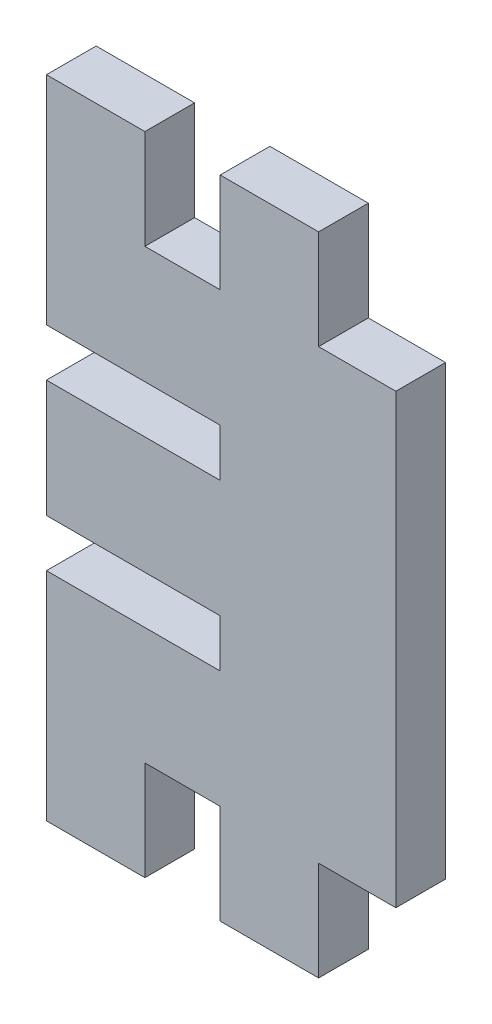
ISO-10303-21;
HEADER;
FILE_DESCRIPTION(('STEP AP214'),'2;1');
FILE_NAME('part.step','',(''),(''),'','','');
FILE_SCHEMA(('AUTOMOTIVE_DESIGN { 1 0 10303 214 1 1 1 1 }'));
ENDSEC;
DATA;
#1=APPLICATION_CONTEXT('core data for automotive mechanical design processes');
#2=APPLICATION_PROTOCOL_DEFINITION('international standard','automotive_design',2000,#1);
#3=PRODUCT_CONTEXT('',#1,'mechanical');
#4=PRODUCT('Part','Part','',(#3));
#5=PRODUCT_RELATED_PRODUCT_CATEGORY('part','',(#4));
#6=PRODUCT_DEFINITION_FORMATION('','',#4);
#7=PRODUCT_DEFINITION_CONTEXT('part definition',#1,'design');
#8=PRODUCT_DEFINITION('design','',#6,#7);
#9=PRODUCT_DEFINITION_SHAPE('','',#8);
#10=(LENGTH_UNIT() NAMED_UNIT(*) SI_UNIT(.MILLI.,.METRE.));
#11=(NAMED_UNIT(*) PLANE_ANGLE_UNIT() SI_UNIT($,.RADIAN.));
#12=(NAMED_UNIT(*) SI_UNIT($,.STERADIAN.) SOLID_ANGLE_UNIT());
#13=UNCERTAINTY_MEASURE_WITH_UNIT(LENGTH_MEASURE(1.E-05),#10,'distance_accuracy_value','');
#14=(GEOMETRIC_REPRESENTATION_CONTEXT(3) GLOBAL_UNCERTAINTY_ASSIGNED_CONTEXT((#13)) GLOBAL_UNIT_ASSIGNED_CONTEXT((#10,
#11,#12)) REPRESENTATION_CONTEXT('',''));
#15=CARTESIAN_POINT('',(0.,0.,0.));
#16=DIRECTION('',(0.,0.,1.));
#17=DIRECTION('',(1.,0.,0.));
#18=AXIS2_PLACEMENT_3D('',#15,#16,#17);
#19=CARTESIAN_POINT('',(-0.0999999999999994,0.,5.15));
#20=DIRECTION('',(1.,0.,0.));
#21=DIRECTION('',(0.,1.,0.));
#22=AXIS2_PLACEMENT_3D('',#19,#20,#21);
#23=PLANE('',#22);
#24=DIRECTION('',(0.,-1.,0.));
#25=VECTOR('',#24,1.);
#26=CARTESIAN_POINT('',(-0.0999999999999994,0.,0.));
#27=LINE('',#26,#25);
#28=CARTESIAN_POINT('',(-0.0999999999999994,-6.075,0.));
#29=VERTEX_POINT('',#28);
#30=CARTESIAN_POINT('',(-0.0999999999999994,-11.025,0.));
#31=VERTEX_POINT('',#30);
#32=EDGE_CURVE('E229',#29,#31,#27,.T.);
#33=ORIENTED_EDGE('',*,*,#32,.T.);
#34=DIRECTION('',(0.,0.,-1.));
#35=VECTOR('',#34,1.);
#36=CARTESIAN_POINT('',(-0.0999999999999994,-11.025,5.15));
#37=LINE('',#36,#35);
#38=CARTESIAN_POINT('',(-0.0999999999999994,-11.025,5.15));
#39=VERTEX_POINT('',#38);
#40=EDGE_CURVE('E12',#39,#31,#37,.T.);
#41=ORIENTED_EDGE('',*,*,#40,.F.);
#42=DIRECTION('',(0.,-1.,0.));
#43=VECTOR('',#42,1.);
#44=CARTESIAN_POINT('',(-0.0999999999999994,0.,5.15));
#45=LINE('',#44,#43);
#46=CARTESIAN_POINT('',(-0.0999999999999994,-6.075,5.15));
#47=VERTEX_POINT('',#46);
#48=EDGE_CURVE('E245',#47,#39,#45,.T.);
#49=ORIENTED_EDGE('',*,*,#48,.F.);
#50=DIRECTION('',(0.,0.,-1.));
#51=VECTOR('',#50,1.);
#52=CARTESIAN_POINT('',(-0.0999999999999994,-6.075,5.15));
#53=LINE('',#52,#51);
#54=EDGE_CURVE('E225',#47,#29,#53,.T.);
#55=ORIENTED_EDGE('',*,*,#54,.T.);
#56=EDGE_LOOP('',(#33,#41,#49,#55));
#57=FACE_BOUND('',#56,.T.);
#58=ADVANCED_FACE('F38',(#57),#23,.F.);
#59=CARTESIAN_POINT('',(0.,-11.025,5.15));
#60=DIRECTION('',(0.,-1.,0.));
#61=DIRECTION('',(0.,0.,-1.));
#62=AXIS2_PLACEMENT_3D('',#59,#60,#61);
#63=PLANE('',#62);
#64=DIRECTION('',(-1.,0.,0.));
#65=VECTOR('',#64,1.);
#66=CARTESIAN_POINT('',(0.,-11.025,0.));
#67=LINE('',#66,#65);
#68=CARTESIAN_POINT('',(-18.1,-11.025,0.));
#69=VERTEX_POINT('',#68);
#70=EDGE_CURVE('E233',#31,#69,#67,.T.);
#71=ORIENTED_EDGE('',*,*,#70,.T.);
#72=DIRECTION('',(0.,0.,-1.));
#73=VECTOR('',#72,1.);
#74=CARTESIAN_POINT('',(-18.1,-11.025,5.15));
#75=LINE('',#74,#73);
#76=CARTESIAN_POINT('',(-18.1,-11.025,5.15));
#77=VERTEX_POINT('',#76);
#78=EDGE_CURVE('E46',#77,#69,#75,.T.);
#79=ORIENTED_EDGE('',*,*,#78,.F.);
#80=DIRECTION('',(-1.,0.,0.));
#81=VECTOR('',#80,1.);
#82=CARTESIAN_POINT('',(0.,-11.025,5.15));
#83=LINE('',#82,#81);
#84=EDGE_CURVE('E141',#39,#77,#83,.T.);
#85=ORIENTED_EDGE('',*,*,#84,.F.);
#86=ORIENTED_EDGE('',*,*,#40,.T.);
#87=EDGE_LOOP('',(#71,#79,#85,#86));
#88=FACE_BOUND('',#87,.T.);
#89=ADVANCED_FACE('F422',(#88),#63,.F.);
#90=CARTESIAN_POINT('',(-18.1,0.,5.15));
#91=DIRECTION('',(1.,0.,0.));
#92=DIRECTION('',(0.,0.,-1.));
#93=AXIS2_PLACEMENT_3D('',#90,#91,#92);
#94=PLANE('',#93);
#95=DIRECTION('',(0.,-1.,0.));
#96=VECTOR('',#95,1.);
#97=CARTESIAN_POINT('',(-18.1,0.,0.));
#98=LINE('',#97,#96);
#99=CARTESIAN_POINT('',(-18.1,-33.475,0.));
#100=VERTEX_POINT('',#99);
#101=EDGE_CURVE('E298',#69,#100,#98,.T.);
#102=ORIENTED_EDGE('',*,*,#101,.T.);
#103=DIRECTION('',(0.,0.,-1.));
#104=VECTOR('',#103,1.);
#105=CARTESIAN_POINT('',(-18.1,-33.475,5.15));
#106=LINE('',#105,#104);
#107=CARTESIAN_POINT('',(-18.1,-33.475,5.15));
#108=VERTEX_POINT('',#107);
#109=EDGE_CURVE('E290',#108,#100,#106,.T.);
#110=ORIENTED_EDGE('',*,*,#109,.F.);
#111=DIRECTION('',(0.,-1.,0.));
#112=VECTOR('',#111,1.);
#113=CARTESIAN_POINT('',(-18.1,0.,5.15));
#114=LINE('',#113,#112);
#115=EDGE_CURVE('E299',#77,#108,#114,.T.);
#116=ORIENTED_EDGE('',*,*,#115,.F.);
#117=ORIENTED_EDGE('',*,*,#78,.T.);
#118=EDGE_LOOP('',(#102,#110,#116,#117));
#119=FACE_BOUND('',#118,.T.);
#120=ADVANCED_FACE('F296',(#119),#94,.F.);
#121=CARTESIAN_POINT('',(0.,-33.475,5.15));
#122=DIRECTION('',(0.,1.,0.));
#123=DIRECTION('',(0.,0.,1.));
#124=AXIS2_PLACEMENT_3D('',#121,#122,#123);
#125=PLANE('',#124);
#126=DIRECTION('',(1.,0.,0.));
#127=VECTOR('',#126,1.);
#128=CARTESIAN_POINT('',(0.,-33.475,0.));
#129=LINE('',#128,#127);
#130=CARTESIAN_POINT('',(-7.89999999999998,-33.475,0.));
#131=VERTEX_POINT('',#130);
#132=EDGE_CURVE('E306',#100,#131,#129,.T.);
#133=ORIENTED_EDGE('',*,*,#132,.T.);
#134=DIRECTION('',(0.,0.,-1.));
#135=VECTOR('',#134,1.);
#136=CARTESIAN_POINT('',(-7.89999999999998,-33.475,5.15));
#137=LINE('',#136,#135);
#138=CARTESIAN_POINT('',(-7.89999999999998,-33.475,5.15));
#139=VERTEX_POINT('',#138);
#140=EDGE_CURVE('E288',#139,#131,#137,.T.);
#141=ORIENTED_EDGE('',*,*,#140,.F.);
#142=DIRECTION('',(1.,0.,0.));
#143=VECTOR('',#142,1.);
#144=CARTESIAN_POINT('',(0.,-33.475,5.15));
#145=LINE('',#144,#143);
#146=EDGE_CURVE('E737',#108,#139,#145,.T.);
#147=ORIENTED_EDGE('',*,*,#146,.F.);
#148=ORIENTED_EDGE('',*,*,#109,.T.);
#149=EDGE_LOOP('',(#133,#141,#147,#148));
#150=FACE_BOUND('',#149,.T.);
#151=ADVANCED_FACE('F429',(#150),#125,.F.);
#152=CARTESIAN_POINT('',(-7.89999999999999,0.,5.15));
#153=DIRECTION('',(1.,0.,0.));
#154=DIRECTION('',(0.,1.,0.));
#155=AXIS2_PLACEMENT_3D('',#152,#153,#154);
#156=PLANE('',#155);
#157=DIRECTION('',(0.,-1.,0.));
#158=VECTOR('',#157,1.);
#159=CARTESIAN_POINT('',(-7.89999999999999,0.,0.));
#160=LINE('',#159,#158);
#161=CARTESIAN_POINT('',(-7.89999999999998,-23.175,0.));
#162=VERTEX_POINT('',#161);
#163=EDGE_CURVE('E310',#162,#131,#160,.T.);
#164=ORIENTED_EDGE('',*,*,#163,.F.);
#165=DIRECTION('',(0.,0.,-1.));
#166=VECTOR('',#165,1.);
#167=CARTESIAN_POINT('',(-7.89999999999998,-23.175,5.15));
#168=LINE('',#167,#166);
#169=CARTESIAN_POINT('',(-7.89999999999998,-23.175,5.15));
#170=VERTEX_POINT('',#169);
#171=EDGE_CURVE('E286',#170,#162,#168,.T.);
#172=ORIENTED_EDGE('',*,*,#171,.F.);
#173=DIRECTION('',(0.,-1.,0.));
#174=VECTOR('',#173,1.);
#175=CARTESIAN_POINT('',(-7.89999999999999,0.,5.15));
#176=LINE('',#175,#174);
#177=EDGE_CURVE('E734',#170,#139,#176,.T.);
#178=ORIENTED_EDGE('',*,*,#177,.T.);
#179=ORIENTED_EDGE('',*,*,#140,.T.);
#180=EDGE_LOOP('',(#164,#172,#178,#179));
#181=FACE_BOUND('',#180,.T.);
#182=ADVANCED_FACE('F434',(#181),#156,.T.);
#183=CARTESIAN_POINT('',(0.,-23.175,5.15));
#184=DIRECTION('',(0.,-1.,0.));
#185=DIRECTION('',(0.,0.,-1.));
#186=AXIS2_PLACEMENT_3D('',#183,#184,#185);
#187=PLANE('',#186);
#188=DIRECTION('',(-1.,0.,0.));
#189=VECTOR('',#188,1.);
#190=CARTESIAN_POINT('',(0.,-23.175,0.));
#191=LINE('',#190,#189);
#192=CARTESIAN_POINT('',(-0.0999999999999943,-23.175,0.));
#193=VERTEX_POINT('',#192);
#194=EDGE_CURVE('E322',#193,#162,#191,.T.);
#195=ORIENTED_EDGE('',*,*,#194,.F.);
#196=DIRECTION('',(0.,0.,-1.));
#197=VECTOR('',#196,1.);
#198=CARTESIAN_POINT('',(-0.0999999999999943,-23.175,5.15));
#199=LINE('',#198,#197);
#200=CARTESIAN_POINT('',(-0.0999999999999943,-23.175,5.15));
#201=VERTEX_POINT('',#200);
#202=EDGE_CURVE('E284',#201,#193,#199,.T.);
#203=ORIENTED_EDGE('',*,*,#202,.F.);
#204=DIRECTION('',(-1.,0.,0.));
#205=VECTOR('',#204,1.);
#206=CARTESIAN_POINT('',(0.,-23.175,5.15));
#207=LINE('',#206,#205);
#208=EDGE_CURVE('E731',#201,#170,#207,.T.);
#209=ORIENTED_EDGE('',*,*,#208,.T.);
#210=ORIENTED_EDGE('',*,*,#171,.T.);
#211=EDGE_LOOP('',(#195,#203,#209,#210));
#212=FACE_BOUND('',#211,.T.);
#213=ADVANCED_FACE('F438',(#212),#187,.T.);
#214=CARTESIAN_POINT('',(-0.1,0.,5.15));
#215=DIRECTION('',(-1.,0.,0.));
#216=DIRECTION('',(0.,-1.,0.));
#217=AXIS2_PLACEMENT_3D('',#214,#215,#216);
#218=PLANE('',#217);
#219=DIRECTION('',(0.,1.,0.));
#220=VECTOR('',#219,1.);
#221=CARTESIAN_POINT('',(-0.1,0.,0.));
#222=LINE('',#221,#220);
#223=CARTESIAN_POINT('',(-0.0999999999999918,-33.475,0.));
#224=VERTEX_POINT('',#223);
#225=EDGE_CURVE('E327',#224,#193,#222,.T.);
#226=ORIENTED_EDGE('',*,*,#225,.F.);
#227=DIRECTION('',(0.,0.,-1.));
#228=VECTOR('',#227,1.);
#229=CARTESIAN_POINT('',(-0.0999999999999918,-33.475,5.15));
#230=LINE('',#229,#228);
#231=CARTESIAN_POINT('',(-0.0999999999999918,-33.475,5.15));
#232=VERTEX_POINT('',#231);
#233=EDGE_CURVE('E282',#232,#224,#230,.T.);
#234=ORIENTED_EDGE('',*,*,#233,.F.);
#235=DIRECTION('',(0.,1.,0.));
#236=VECTOR('',#235,1.);
#237=CARTESIAN_POINT('',(-0.1,0.,5.15));
#238=LINE('',#237,#236);
#239=EDGE_CURVE('E728',#232,#201,#238,.T.);
#240=ORIENTED_EDGE('',*,*,#239,.T.);
#241=ORIENTED_EDGE('',*,*,#202,.T.);
#242=EDGE_LOOP('',(#226,#234,#240,#241));
#243=FACE_BOUND('',#242,.T.);
#244=ADVANCED_FACE('F442',(#243),#218,.T.);
#245=CARTESIAN_POINT('',(0.,-33.475,5.15));
#246=DIRECTION('',(0.,1.,0.));
#247=DIRECTION('',(0.,0.,1.));
#248=AXIS2_PLACEMENT_3D('',#245,#246,#247);
#249=PLANE('',#248);
#250=DIRECTION('',(1.,0.,0.));
#251=VECTOR('',#250,1.);
#252=CARTESIAN_POINT('',(0.,-33.475,0.));
#253=LINE('',#252,#251);
#254=CARTESIAN_POINT('',(10.1,-33.475,0.));
#255=VERTEX_POINT('',#254);
#256=EDGE_CURVE('E332',#224,#255,#253,.T.);
#257=ORIENTED_EDGE('',*,*,#256,.T.);
#258=DIRECTION('',(0.,0.,-1.));
#259=VECTOR('',#258,1.);
#260=CARTESIAN_POINT('',(10.1,-33.475,5.15));
#261=LINE('',#260,#259);
#262=CARTESIAN_POINT('',(10.1,-33.475,5.15));
#263=VERTEX_POINT('',#262);
#264=EDGE_CURVE('E279',#263,#255,#261,.T.);
#265=ORIENTED_EDGE('',*,*,#264,.F.);
#266=DIRECTION('',(1.,0.,0.));
#267=VECTOR('',#266,1.);
#268=CARTESIAN_POINT('',(0.,-33.475,5.15));
#269=LINE('',#268,#267);
#270=EDGE_CURVE('E683',#232,#263,#269,.T.);
#271=ORIENTED_EDGE('',*,*,#270,.F.);
#272=ORIENTED_EDGE('',*,*,#233,.T.);
#273=EDGE_LOOP('',(#257,#265,#271,#272));
#274=FACE_BOUND('',#273,.T.);
#275=ADVANCED_FACE('F446',(#274),#249,.F.);
#276=CARTESIAN_POINT('',(10.1,0.,5.15));
#277=DIRECTION('',(-1.,0.,0.));
#278=DIRECTION('',(0.,0.,1.));
#279=AXIS2_PLACEMENT_3D('',#276,#277,#278);
#280=PLANE('',#279);
#281=DIRECTION('',(0.,1.,0.));
#282=VECTOR('',#281,1.);
#283=CARTESIAN_POINT('',(10.1,0.,0.));
#284=LINE('',#283,#282);
#285=CARTESIAN_POINT('',(10.1,-23.175,0.));
#286=VERTEX_POINT('',#285);
#287=EDGE_CURVE('E340',#255,#286,#284,.T.);
#288=ORIENTED_EDGE('',*,*,#287,.T.);
#289=DIRECTION('',(0.,0.,-1.));
#290=VECTOR('',#289,1.);
#291=CARTESIAN_POINT('',(10.1,-23.175,5.15));
#292=LINE('',#291,#290);
#293=CARTESIAN_POINT('',(10.1,-23.175,5.15));
#294=VERTEX_POINT('',#293);
#295=EDGE_CURVE('E276',#294,#286,#292,.T.);
#296=ORIENTED_EDGE('',*,*,#295,.F.);
#297=DIRECTION('',(0.,1.,0.));
#298=VECTOR('',#297,1.);
#299=CARTESIAN_POINT('',(10.1,0.,5.15));
#300=LINE('',#299,#298);
#301=EDGE_CURVE('E671',#263,#294,#300,.T.);
#302=ORIENTED_EDGE('',*,*,#301,.F.);
#303=ORIENTED_EDGE('',*,*,#264,.T.);
#304=EDGE_LOOP('',(#288,#296,#302,#303));
#305=FACE_BOUND('',#304,.T.);
#306=ADVANCED_FACE('F450',(#305),#280,.F.);
#307=CARTESIAN_POINT('',(0.,-23.175,5.15));
#308=DIRECTION('',(0.,1.,0.));
#309=DIRECTION('',(0.,0.,1.));
#310=AXIS2_PLACEMENT_3D('',#307,#308,#309);
#311=PLANE('',#310);
#312=DIRECTION('',(1.,0.,0.));
#313=VECTOR('',#312,1.);
#314=CARTESIAN_POINT('',(0.,-23.175,0.));
#315=LINE('',#314,#313);
#316=CARTESIAN_POINT('',(18.1,-23.175,0.));
#317=VERTEX_POINT('',#316);
#318=EDGE_CURVE('E343',#286,#317,#315,.T.);
#319=ORIENTED_EDGE('',*,*,#318,.T.);
#320=DIRECTION('',(0.,0.,-1.));
#321=VECTOR('',#320,1.);
#322=CARTESIAN_POINT('',(18.1,-23.175,5.15));
#323=LINE('',#322,#321);
#324=CARTESIAN_POINT('',(18.1,-23.175,5.15));
#325=VERTEX_POINT('',#324);
#326=EDGE_CURVE('E274',#325,#317,#323,.T.);
#327=ORIENTED_EDGE('',*,*,#326,.F.);
#328=DIRECTION('',(1.,0.,0.));
#329=VECTOR('',#328,1.);
#330=CARTESIAN_POINT('',(0.,-23.175,5.15));
#331=LINE('',#330,#329);
#332=EDGE_CURVE('E677',#294,#325,#331,.T.);
#333=ORIENTED_EDGE('',*,*,#332,.F.);
#334=ORIENTED_EDGE('',*,*,#295,.T.);
#335=EDGE_LOOP('',(#319,#327,#333,#334));
#336=FACE_BOUND('',#335,.T.);
#337=ADVANCED_FACE('F454',(#336),#311,.F.);
#338=CARTESIAN_POINT('',(18.1,0.,5.15));
#339=DIRECTION('',(1.,0.,0.));
#340=DIRECTION('',(0.,0.,-1.));
#341=AXIS2_PLACEMENT_3D('',#338,#339,#340);
#342=PLANE('',#341);
#343=DIRECTION('',(0.,-1.,0.));
#344=VECTOR('',#343,1.);
#345=CARTESIAN_POINT('',(18.1,0.,0.));
#346=LINE('',#345,#344);
#347=CARTESIAN_POINT('',(18.1,23.175,0.));
#348=VERTEX_POINT('',#347);
#349=EDGE_CURVE('E348',#348,#317,#346,.T.);
#350=ORIENTED_EDGE('',*,*,#349,.F.);
#351=DIRECTION('',(0.,0.,-1.));
#352=VECTOR('',#351,1.);
#353=CARTESIAN_POINT('',(18.1,23.175,5.15));
#354=LINE('',#353,#352);
#355=CARTESIAN_POINT('',(18.1,23.175,5.15));
#356=VERTEX_POINT('',#355);
#357=EDGE_CURVE('E272',#356,#348,#354,.T.);
#358=ORIENTED_EDGE('',*,*,#357,.F.);
#359=DIRECTION('',(0.,-1.,0.));
#360=VECTOR('',#359,1.);
#361=CARTESIAN_POINT('',(18.1,0.,5.15));
#362=LINE('',#361,#360);
#363=EDGE_CURVE('E679',#356,#325,#362,.T.);
#364=ORIENTED_EDGE('',*,*,#363,.T.);
#365=ORIENTED_EDGE('',*,*,#326,.T.);
#366=EDGE_LOOP('',(#350,#358,#364,#365));
#367=FACE_BOUND('',#366,.T.);
#368=ADVANCED_FACE('F458',(#367),#342,.T.);
#369=CARTESIAN_POINT('',(0.,23.175,5.15));
#370=DIRECTION('',(0.,1.,0.));
#371=DIRECTION('',(0.,0.,1.));
#372=AXIS2_PLACEMENT_3D('',#369,#370,#371);
#373=PLANE('',#372);
#374=DIRECTION('',(1.,0.,0.));
#375=VECTOR('',#374,1.);
#376=CARTESIAN_POINT('',(0.,23.175,0.));
#377=LINE('',#376,#375);
#378=CARTESIAN_POINT('',(10.1,23.175,0.));
#379=VERTEX_POINT('',#378);
#380=EDGE_CURVE('E353',#379,#348,#377,.T.);
#381=ORIENTED_EDGE('',*,*,#380,.F.);
#382=DIRECTION('',(0.,0.,-1.));
#383=VECTOR('',#382,1.);
#384=CARTESIAN_POINT('',(10.1,23.175,5.15));
#385=LINE('',#384,#383);
#386=CARTESIAN_POINT('',(10.1,23.175,5.15));
#387=VERTEX_POINT('',#386);
#388=EDGE_CURVE('E270',#387,#379,#385,.T.);
#389=ORIENTED_EDGE('',*,*,#388,.F.);
#390=DIRECTION('',(1.,0.,0.));
#391=VECTOR('',#390,1.);
#392=CARTESIAN_POINT('',(0.,23.175,5.15));
#393=LINE('',#392,#391);
#394=EDGE_CURVE('E681',#387,#356,#393,.T.);
#395=ORIENTED_EDGE('',*,*,#394,.T.);
#396=ORIENTED_EDGE('',*,*,#357,.T.);
#397=EDGE_LOOP('',(#381,#389,#395,#396));
#398=FACE_BOUND('',#397,.T.);
#399=ADVANCED_FACE('F462',(#398),#373,.T.);
#400=CARTESIAN_POINT('',(10.1,0.,5.15));
#401=DIRECTION('',(1.,0.,0.));
#402=DIRECTION('',(0.,1.,0.));
#403=AXIS2_PLACEMENT_3D('',#400,#401,#402);
#404=PLANE('',#403);
#405=DIRECTION('',(0.,-1.,0.));
#406=VECTOR('',#405,1.);
#407=CARTESIAN_POINT('',(10.1,0.,0.));
#408=LINE('',#407,#406);
#409=CARTESIAN_POINT('',(10.1,33.475,0.));
#410=VERTEX_POINT('',#409);
#411=EDGE_CURVE('E361',#410,#379,#408,.T.);
#412=ORIENTED_EDGE('',*,*,#411,.F.);
#413=DIRECTION('',(0.,0.,-1.));
#414=VECTOR('',#413,1.);
#415=CARTESIAN_POINT('',(10.1,33.475,5.15));
#416=LINE('',#415,#414);
#417=CARTESIAN_POINT('',(10.1,33.475,5.15));
#418=VERTEX_POINT('',#417);
#419=EDGE_CURVE('E268',#418,#410,#416,.T.);
#420=ORIENTED_EDGE('',*,*,#419,.F.);
#421=DIRECTION('',(0.,-1.,0.));
#422=VECTOR('',#421,1.);
#423=CARTESIAN_POINT('',(10.1,0.,5.15));
#424=LINE('',#423,#422);
#425=EDGE_CURVE('E689',#418,#387,#424,.T.);
#426=ORIENTED_EDGE('',*,*,#425,.T.);
#427=ORIENTED_EDGE('',*,*,#388,.T.);
#428=EDGE_LOOP('',(#412,#420,#426,#427));
#429=FACE_BOUND('',#428,.T.);
#430=ADVANCED_FACE('F466',(#429),#404,.T.);
#431=CARTESIAN_POINT('',(0.,33.475,5.15));
#432=DIRECTION('',(0.,1.,0.));
#433=DIRECTION('',(0.,0.,1.));
#434=AXIS2_PLACEMENT_3D('',#431,#432,#433);
#435=PLANE('',#434);
#436=DIRECTION('',(1.,0.,0.));
#437=VECTOR('',#436,1.);
#438=CARTESIAN_POINT('',(0.,33.475,0.));
#439=LINE('',#438,#437);
#440=CARTESIAN_POINT('',(-0.1,33.475,0.));
#441=VERTEX_POINT('',#440);
#442=EDGE_CURVE('E365',#441,#410,#439,.T.);
#443=ORIENTED_EDGE('',*,*,#442,.F.);
#444=DIRECTION('',(0.,0.,-1.));
#445=VECTOR('',#444,1.);
#446=CARTESIAN_POINT('',(-0.1,33.475,5.15));
#447=LINE('',#446,#445);
#448=CARTESIAN_POINT('',(-0.1,33.475,5.15));
#449=VERTEX_POINT('',#448);
#450=EDGE_CURVE('E266',#449,#441,#447,.T.);
#451=ORIENTED_EDGE('',*,*,#450,.F.);
#452=DIRECTION('',(1.,0.,0.));
#453=VECTOR('',#452,1.);
#454=CARTESIAN_POINT('',(0.,33.475,5.15));
#455=LINE('',#454,#453);
#456=EDGE_CURVE('E692',#449,#418,#455,.T.);
#457=ORIENTED_EDGE('',*,*,#456,.T.);
#458=ORIENTED_EDGE('',*,*,#419,.T.);
#459=EDGE_LOOP('',(#443,#451,#457,#458));
#460=FACE_BOUND('',#459,.T.);
#461=ADVANCED_FACE('F470',(#460),#435,.T.);
#462=CARTESIAN_POINT('',(-0.0999999999999959,0.,5.15));
#463=DIRECTION('',(1.,0.,0.));
#464=DIRECTION('',(0.,1.,0.));
#465=AXIS2_PLACEMENT_3D('',#462,#463,#464);
#466=PLANE('',#465);
#467=DIRECTION('',(0.,-1.,0.));
#468=VECTOR('',#467,1.);
#469=CARTESIAN_POINT('',(-0.0999999999999959,0.,0.));
#470=LINE('',#469,#468);
#471=CARTESIAN_POINT('',(-0.0999999999999987,23.175,0.));
#472=VERTEX_POINT('',#471);
#473=EDGE_CURVE('E370',#441,#472,#470,.T.);
#474=ORIENTED_EDGE('',*,*,#473,.T.);
#475=DIRECTION('',(0.,0.,-1.));
#476=VECTOR('',#475,1.);
#477=CARTESIAN_POINT('',(-0.0999999999999987,23.175,5.15));
#478=LINE('',#477,#476);
#479=CARTESIAN_POINT('',(-0.0999999999999987,23.175,5.15));
#480=VERTEX_POINT('',#479);
#481=EDGE_CURVE('E263',#480,#472,#478,.T.);
#482=ORIENTED_EDGE('',*,*,#481,.F.);
#483=DIRECTION('',(0.,-1.,0.));
#484=VECTOR('',#483,1.);
#485=CARTESIAN_POINT('',(-0.0999999999999959,0.,5.15));
#486=LINE('',#485,#484);
#487=EDGE_CURVE('E695',#449,#480,#486,.T.);
#488=ORIENTED_EDGE('',*,*,#487,.F.);
#489=ORIENTED_EDGE('',*,*,#450,.T.);
#490=EDGE_LOOP('',(#474,#482,#488,#489));
#491=FACE_BOUND('',#490,.T.);
#492=ADVANCED_FACE('F474',(#491),#466,.F.);
#493=CARTESIAN_POINT('',(0.,23.175,5.15));
#494=DIRECTION('',(0.,-1.,0.));
#495=DIRECTION('',(0.,0.,-1.));
#496=AXIS2_PLACEMENT_3D('',#493,#494,#495);
#497=PLANE('',#496);
#498=DIRECTION('',(-1.,0.,0.));
#499=VECTOR('',#498,1.);
#500=CARTESIAN_POINT('',(0.,23.175,0.));
#501=LINE('',#500,#499);
#502=CARTESIAN_POINT('',(-7.89999999999998,23.175,0.));
#503=VERTEX_POINT('',#502);
#504=EDGE_CURVE('E374',#472,#503,#501,.T.);
#505=ORIENTED_EDGE('',*,*,#504,.T.);
#506=DIRECTION('',(0.,0.,-1.));
#507=VECTOR('',#506,1.);
#508=CARTESIAN_POINT('',(-7.89999999999998,23.175,5.15));
#509=LINE('',#508,#507);
#510=CARTESIAN_POINT('',(-7.89999999999998,23.175,5.15));
#511=VERTEX_POINT('',#510);
#512=EDGE_CURVE('E260',#511,#503,#509,.T.);
#513=ORIENTED_EDGE('',*,*,#512,.F.);
#514=DIRECTION('',(-1.,0.,0.));
#515=VECTOR('',#514,1.);
#516=CARTESIAN_POINT('',(0.,23.175,5.15));
#517=LINE('',#516,#515);
#518=EDGE_CURVE('E697',#480,#511,#517,.T.);
#519=ORIENTED_EDGE('',*,*,#518,.F.);
#520=ORIENTED_EDGE('',*,*,#481,.T.);
#521=EDGE_LOOP('',(#505,#513,#519,#520));
#522=FACE_BOUND('',#521,.T.);
#523=ADVANCED_FACE('F478',(#522),#497,.F.);
#524=CARTESIAN_POINT('',(-7.89999999999998,0.,5.15));
#525=DIRECTION('',(-1.,0.,0.));
#526=DIRECTION('',(0.,0.,1.));
#527=AXIS2_PLACEMENT_3D('',#524,#525,#526);
#528=PLANE('',#527);
#529=DIRECTION('',(0.,1.,0.));
#530=VECTOR('',#529,1.);
#531=CARTESIAN_POINT('',(-7.89999999999998,0.,0.));
#532=LINE('',#531,#530);
#533=CARTESIAN_POINT('',(-7.89999999999998,33.475,0.));
#534=VERTEX_POINT('',#533);
#535=EDGE_CURVE('E382',#503,#534,#532,.T.);
#536=ORIENTED_EDGE('',*,*,#535,.T.);
#537=DIRECTION('',(0.,0.,-1.));
#538=VECTOR('',#537,1.);
#539=CARTESIAN_POINT('',(-7.89999999999998,33.475,5.15));
#540=LINE('',#539,#538);
#541=CARTESIAN_POINT('',(-7.89999999999998,33.475,5.15));
#542=VERTEX_POINT('',#541);
#543=EDGE_CURVE('E258',#542,#534,#540,.T.);
#544=ORIENTED_EDGE('',*,*,#543,.F.);
#545=DIRECTION('',(0.,1.,0.));
#546=VECTOR('',#545,1.);
#547=CARTESIAN_POINT('',(-7.89999999999998,0.,5.15));
#548=LINE('',#547,#546);
#549=EDGE_CURVE('E699',#511,#542,#548,.T.);
#550=ORIENTED_EDGE('',*,*,#549,.F.);
#551=ORIENTED_EDGE('',*,*,#512,.T.);
#552=EDGE_LOOP('',(#536,#544,#550,#551));
#553=FACE_BOUND('',#552,.T.);
#554=ADVANCED_FACE('F482',(#553),#528,.F.);
#555=CARTESIAN_POINT('',(0.,33.475,5.15));
#556=DIRECTION('',(0.,1.,0.));
#557=DIRECTION('',(0.,0.,1.));
#558=AXIS2_PLACEMENT_3D('',#555,#556,#557);
#559=PLANE('',#558);
#560=DIRECTION('',(1.,0.,0.));
#561=VECTOR('',#560,1.);
#562=CARTESIAN_POINT('',(0.,33.475,0.));
#563=LINE('',#562,#561);
#564=CARTESIAN_POINT('',(-18.1,33.475,0.));
#565=VERTEX_POINT('',#564);
#566=EDGE_CURVE('E386',#565,#534,#563,.T.);
#567=ORIENTED_EDGE('',*,*,#566,.F.);
#568=DIRECTION('',(0.,0.,-1.));
#569=VECTOR('',#568,1.);
#570=CARTESIAN_POINT('',(-18.1,33.475,5.15));
#571=LINE('',#570,#569);
#572=CARTESIAN_POINT('',(-18.1,33.475,5.15));
#573=VERTEX_POINT('',#572);
#574=EDGE_CURVE('E256',#573,#565,#571,.T.);
#575=ORIENTED_EDGE('',*,*,#574,.F.);
#576=DIRECTION('',(1.,0.,0.));
#577=VECTOR('',#576,1.);
#578=CARTESIAN_POINT('',(0.,33.475,5.15));
#579=LINE('',#578,#577);
#580=EDGE_CURVE('E701',#573,#542,#579,.T.);
#581=ORIENTED_EDGE('',*,*,#580,.T.);
#582=ORIENTED_EDGE('',*,*,#543,.T.);
#583=EDGE_LOOP('',(#567,#575,#581,#582));
#584=FACE_BOUND('',#583,.T.);
#585=ADVANCED_FACE('F486',(#584),#559,.T.);
#586=CARTESIAN_POINT('',(-18.1,0.,5.15));
#587=DIRECTION('',(-1.,0.,0.));
#588=DIRECTION('',(0.,0.,1.));
#589=AXIS2_PLACEMENT_3D('',#586,#587,#588);
#590=PLANE('',#589);
#591=DIRECTION('',(0.,1.,0.));
#592=VECTOR('',#591,1.);
#593=CARTESIAN_POINT('',(-18.1,0.,0.));
#594=LINE('',#593,#592);
#595=CARTESIAN_POINT('',(-18.1,11.025,0.));
#596=VERTEX_POINT('',#595);
#597=EDGE_CURVE('E391',#596,#565,#594,.T.);
#598=ORIENTED_EDGE('',*,*,#597,.F.);
#599=DIRECTION('',(0.,0.,-1.));
#600=VECTOR('',#599,1.);
#601=CARTESIAN_POINT('',(-18.1,11.025,5.15));
#602=LINE('',#601,#600);
#603=CARTESIAN_POINT('',(-18.1,11.025,5.15));
#604=VERTEX_POINT('',#603);
#605=EDGE_CURVE('E254',#604,#596,#602,.T.);
#606=ORIENTED_EDGE('',*,*,#605,.F.);
#607=DIRECTION('',(0.,1.,0.));
#608=VECTOR('',#607,1.);
#609=CARTESIAN_POINT('',(-18.1,0.,5.15));
#610=LINE('',#609,#608);
#611=EDGE_CURVE('E704',#604,#573,#610,.T.);
#612=ORIENTED_EDGE('',*,*,#611,.T.);
#613=ORIENTED_EDGE('',*,*,#574,.T.);
#614=EDGE_LOOP('',(#598,#606,#612,#613));
#615=FACE_BOUND('',#614,.T.);
#616=ADVANCED_FACE('F490',(#615),#590,.T.);
#617=CARTESIAN_POINT('',(0.,11.025,5.15));
#618=DIRECTION('',(0.,-1.,0.));
#619=DIRECTION('',(1.,0.,0.));
#620=AXIS2_PLACEMENT_3D('',#617,#618,#619);
#621=PLANE('',#620);
#622=DIRECTION('',(-1.,0.,0.));
#623=VECTOR('',#622,1.);
#624=CARTESIAN_POINT('',(0.,11.025,0.));
#625=LINE('',#624,#623);
#626=CARTESIAN_POINT('',(-0.100000000000003,11.025,0.));
#627=VERTEX_POINT('',#626);
#628=EDGE_CURVE('E396',#627,#596,#625,.T.);
#629=ORIENTED_EDGE('',*,*,#628,.F.);
#630=DIRECTION('',(0.,0.,-1.));
#631=VECTOR('',#630,1.);
#632=CARTESIAN_POINT('',(-0.100000000000003,11.025,5.15));
#633=LINE('',#632,#631);
#634=CARTESIAN_POINT('',(-0.100000000000003,11.025,5.15));
#635=VERTEX_POINT('',#634);
#636=EDGE_CURVE('E252',#635,#627,#633,.T.);
#637=ORIENTED_EDGE('',*,*,#636,.F.);
#638=DIRECTION('',(-1.,0.,0.));
#639=VECTOR('',#638,1.);
#640=CARTESIAN_POINT('',(0.,11.025,5.15));
#641=LINE('',#640,#639);
#642=EDGE_CURVE('E707',#635,#604,#641,.T.);
#643=ORIENTED_EDGE('',*,*,#642,.T.);
#644=ORIENTED_EDGE('',*,*,#605,.T.);
#645=EDGE_LOOP('',(#629,#637,#643,#644));
#646=FACE_BOUND('',#645,.T.);
#647=ADVANCED_FACE('F494',(#646),#621,.T.);
#648=CARTESIAN_POINT('',(-0.0999999999999959,0.,5.15));
#649=DIRECTION('',(-1.,0.,0.));
#650=DIRECTION('',(0.,-1.,0.));
#651=AXIS2_PLACEMENT_3D('',#648,#649,#650);
#652=PLANE('',#651);
#653=DIRECTION('',(0.,1.,0.));
#654=VECTOR('',#653,1.);
#655=CARTESIAN_POINT('',(-0.0999999999999959,0.,0.));
#656=LINE('',#655,#654);
#657=CARTESIAN_POINT('',(-0.0999999999999998,6.075,0.));
#658=VERTEX_POINT('',#657);
#659=EDGE_CURVE('E401',#658,#627,#656,.T.);
#660=ORIENTED_EDGE('',*,*,#659,.F.);
#661=DIRECTION('',(0.,0.,-1.));
#662=VECTOR('',#661,1.);
#663=CARTESIAN_POINT('',(-0.0999999999999998,6.075,5.15));
#664=LINE('',#663,#662);
#665=CARTESIAN_POINT('',(-0.0999999999999998,6.075,5.15));
#666=VERTEX_POINT('',#665);
#667=EDGE_CURVE('E214',#666,#658,#664,.T.);
#668=ORIENTED_EDGE('',*,*,#667,.F.);
#669=DIRECTION('',(0.,1.,0.));
#670=VECTOR('',#669,1.);
#671=CARTESIAN_POINT('',(-0.0999999999999959,0.,5.15));
#672=LINE('',#671,#670);
#673=EDGE_CURVE('E221',#666,#635,#672,.T.);
#674=ORIENTED_EDGE('',*,*,#673,.T.);
#675=ORIENTED_EDGE('',*,*,#636,.T.);
#676=EDGE_LOOP('',(#660,#668,#674,#675));
#677=FACE_BOUND('',#676,.T.);
#678=ADVANCED_FACE('F498',(#677),#652,.T.);
#679=CARTESIAN_POINT('',(0.,6.075,5.15));
#680=DIRECTION('',(0.,1.,0.));
#681=DIRECTION('',(0.,0.,1.));
#682=AXIS2_PLACEMENT_3D('',#679,#680,#681);
#683=PLANE('',#682);
#684=DIRECTION('',(1.,0.,0.));
#685=VECTOR('',#684,1.);
#686=CARTESIAN_POINT('',(0.,6.075,0.));
#687=LINE('',#686,#685);
#688=CARTESIAN_POINT('',(-18.1,6.075,0.));
#689=VERTEX_POINT('',#688);
#690=EDGE_CURVE('E209',#689,#658,#687,.T.);
#691=ORIENTED_EDGE('',*,*,#690,.F.);
#692=DIRECTION('',(0.,0.,-1.));
#693=VECTOR('',#692,1.);
#694=CARTESIAN_POINT('',(-18.1,6.075,5.15));
#695=LINE('',#694,#693);
#696=CARTESIAN_POINT('',(-18.1,6.075,5.15));
#697=VERTEX_POINT('',#696);
#698=EDGE_CURVE('E204',#697,#689,#695,.T.);
#699=ORIENTED_EDGE('',*,*,#698,.F.);
#700=DIRECTION('',(1.,0.,0.));
#701=VECTOR('',#700,1.);
#702=CARTESIAN_POINT('',(0.,6.075,5.15));
#703=LINE('',#702,#701);
#704=EDGE_CURVE('E207',#697,#666,#703,.T.);
#705=ORIENTED_EDGE('',*,*,#704,.T.);
#706=ORIENTED_EDGE('',*,*,#667,.T.);
#707=EDGE_LOOP('',(#691,#699,#705,#706));
#708=FACE_BOUND('',#707,.T.);
#709=ADVANCED_FACE('F206',(#708),#683,.T.);
#710=CARTESIAN_POINT('',(-18.1,0.,5.15));
#711=DIRECTION('',(-1.,0.,0.));
#712=DIRECTION('',(0.,0.,1.));
#713=AXIS2_PLACEMENT_3D('',#710,#711,#712);
#714=PLANE('',#713);
#715=DIRECTION('',(0.,1.,0.));
#716=VECTOR('',#715,1.);
#717=CARTESIAN_POINT('',(-18.1,0.,0.));
#718=LINE('',#717,#716);
#719=CARTESIAN_POINT('',(-18.1,-6.075,0.));
#720=VERTEX_POINT('',#719);
#721=EDGE_CURVE('E246',#720,#689,#718,.T.);
#722=ORIENTED_EDGE('',*,*,#721,.F.);
#723=DIRECTION('',(0.,0.,-1.));
#724=VECTOR('',#723,1.);
#725=CARTESIAN_POINT('',(-18.1,-6.075,5.15));
#726=LINE('',#725,#724);
#727=CARTESIAN_POINT('',(-18.1,-6.075,5.15));
#728=VERTEX_POINT('',#727);
#729=EDGE_CURVE('E130',#728,#720,#726,.T.);
#730=ORIENTED_EDGE('',*,*,#729,.F.);
#731=DIRECTION('',(0.,1.,0.));
#732=VECTOR('',#731,1.);
#733=CARTESIAN_POINT('',(-18.1,0.,5.15));
#734=LINE('',#733,#732);
#735=EDGE_CURVE('E218',#728,#697,#734,.T.);
#736=ORIENTED_EDGE('',*,*,#735,.T.);
#737=ORIENTED_EDGE('',*,*,#698,.T.);
#738=EDGE_LOOP('',(#722,#730,#736,#737));
#739=FACE_BOUND('',#738,.T.);
#740=ADVANCED_FACE('F223',(#739),#714,.T.);
#741=CARTESIAN_POINT('',(0.,-6.075,5.15));
#742=DIRECTION('',(0.,1.,0.));
#743=DIRECTION('',(0.,0.,1.));
#744=AXIS2_PLACEMENT_3D('',#741,#742,#743);
#745=PLANE('',#744);
#746=DIRECTION('',(1.,0.,0.));
#747=VECTOR('',#746,1.);
#748=CARTESIAN_POINT('',(0.,-6.075,0.));
#749=LINE('',#748,#747);
#750=EDGE_CURVE('E133',#720,#29,#749,.T.);
#751=ORIENTED_EDGE('',*,*,#750,.T.);
#752=ORIENTED_EDGE('',*,*,#54,.F.);
#753=DIRECTION('',(1.,0.,0.));
#754=VECTOR('',#753,1.);
#755=CARTESIAN_POINT('',(0.,-6.075,5.15));
#756=LINE('',#755,#754);
#757=EDGE_CURVE('E54',#728,#47,#756,.T.);
#758=ORIENTED_EDGE('',*,*,#757,.F.);
#759=ORIENTED_EDGE('',*,*,#729,.T.);
#760=EDGE_LOOP('',(#751,#752,#758,#759));
#761=FACE_BOUND('',#760,.T.);
#762=ADVANCED_FACE('F411',(#761),#745,.F.);
#763=CARTESIAN_POINT('',(0.,0.,5.15));
#764=DIRECTION('',(0.,0.,1.));
#765=DIRECTION('',(1.,0.,0.));
#766=AXIS2_PLACEMENT_3D('',#763,#764,#765);
#767=PLANE('',#766);
#768=ORIENTED_EDGE('',*,*,#48,.T.);
#769=ORIENTED_EDGE('',*,*,#84,.T.);
#770=ORIENTED_EDGE('',*,*,#115,.T.);
#771=ORIENTED_EDGE('',*,*,#146,.T.);
#772=ORIENTED_EDGE('',*,*,#177,.F.);
#773=ORIENTED_EDGE('',*,*,#208,.F.);
#774=ORIENTED_EDGE('',*,*,#239,.F.);
#775=ORIENTED_EDGE('',*,*,#270,.T.);
#776=ORIENTED_EDGE('',*,*,#301,.T.);
#777=ORIENTED_EDGE('',*,*,#332,.T.);
#778=ORIENTED_EDGE('',*,*,#363,.F.);
#779=ORIENTED_EDGE('',*,*,#394,.F.);
#780=ORIENTED_EDGE('',*,*,#425,.F.);
#781=ORIENTED_EDGE('',*,*,#456,.F.);
#782=ORIENTED_EDGE('',*,*,#487,.T.);
#783=ORIENTED_EDGE('',*,*,#518,.T.);
#784=ORIENTED_EDGE('',*,*,#549,.T.);
#785=ORIENTED_EDGE('',*,*,#580,.F.);
#786=ORIENTED_EDGE('',*,*,#611,.F.);
#787=ORIENTED_EDGE('',*,*,#642,.F.);
#788=ORIENTED_EDGE('',*,*,#673,.F.);
#789=ORIENTED_EDGE('',*,*,#704,.F.);
#790=ORIENTED_EDGE('',*,*,#735,.F.);
#791=ORIENTED_EDGE('',*,*,#757,.T.);
#792=EDGE_LOOP('',(#768,#769,#770,#771,#772,#773,#774,#775,#776,#777,#778,#779,#780,#781,#782,
#783,#784,#785,#786,#787,#788,#789,#790,#791));
#793=FACE_BOUND('',#792,.T.);
#794=ADVANCED_FACE('F217',(#793),#767,.T.);
#795=CARTESIAN_POINT('',(0.,0.,0.));
#796=DIRECTION('',(0.,0.,1.));
#797=DIRECTION('',(1.,0.,0.));
#798=AXIS2_PLACEMENT_3D('',#795,#796,#797);
#799=PLANE('',#798);
#800=ORIENTED_EDGE('',*,*,#32,.F.);
#801=ORIENTED_EDGE('',*,*,#750,.F.);
#802=ORIENTED_EDGE('',*,*,#721,.T.);
#803=ORIENTED_EDGE('',*,*,#690,.T.);
#804=ORIENTED_EDGE('',*,*,#659,.T.);
#805=ORIENTED_EDGE('',*,*,#628,.T.);
#806=ORIENTED_EDGE('',*,*,#597,.T.);
#807=ORIENTED_EDGE('',*,*,#566,.T.);
#808=ORIENTED_EDGE('',*,*,#535,.F.);
#809=ORIENTED_EDGE('',*,*,#504,.F.);
#810=ORIENTED_EDGE('',*,*,#473,.F.);
#811=ORIENTED_EDGE('',*,*,#442,.T.);
#812=ORIENTED_EDGE('',*,*,#411,.T.);
#813=ORIENTED_EDGE('',*,*,#380,.T.);
#814=ORIENTED_EDGE('',*,*,#349,.T.);
#815=ORIENTED_EDGE('',*,*,#318,.F.);
#816=ORIENTED_EDGE('',*,*,#287,.F.);
#817=ORIENTED_EDGE('',*,*,#256,.F.);
#818=ORIENTED_EDGE('',*,*,#225,.T.);
#819=ORIENTED_EDGE('',*,*,#194,.T.);
#820=ORIENTED_EDGE('',*,*,#163,.T.);
#821=ORIENTED_EDGE('',*,*,#132,.F.);
#822=ORIENTED_EDGE('',*,*,#101,.F.);
#823=ORIENTED_EDGE('',*,*,#70,.F.);
#824=EDGE_LOOP('',(#800,#801,#802,#803,#804,#805,#806,#807,#808,#809,#810,#811,#812,#813,#814,
#815,#816,#817,#818,#819,#820,#821,#822,#823));
#825=FACE_BOUND('',#824,.T.);
#826=ADVANCED_FACE('F303',(#825),#799,.F.);
#827=CLOSED_SHELL('',(#58,#89,#120,#151,#182,#213,#244,#275,#306,#337,#368,#399,#430,#461,#492,
#523,#554,#585,#616,#647,#678,#709,#740,#762,#794,#826));
#828=MANIFOLD_SOLID_BREP('B2',#827);
#829=ADVANCED_BREP_SHAPE_REPRESENTATION('',(#18,#828),#14);
#830=SHAPE_DEFINITION_REPRESENTATION(#9,#829);
ENDSEC;
END-ISO-10303-21;
